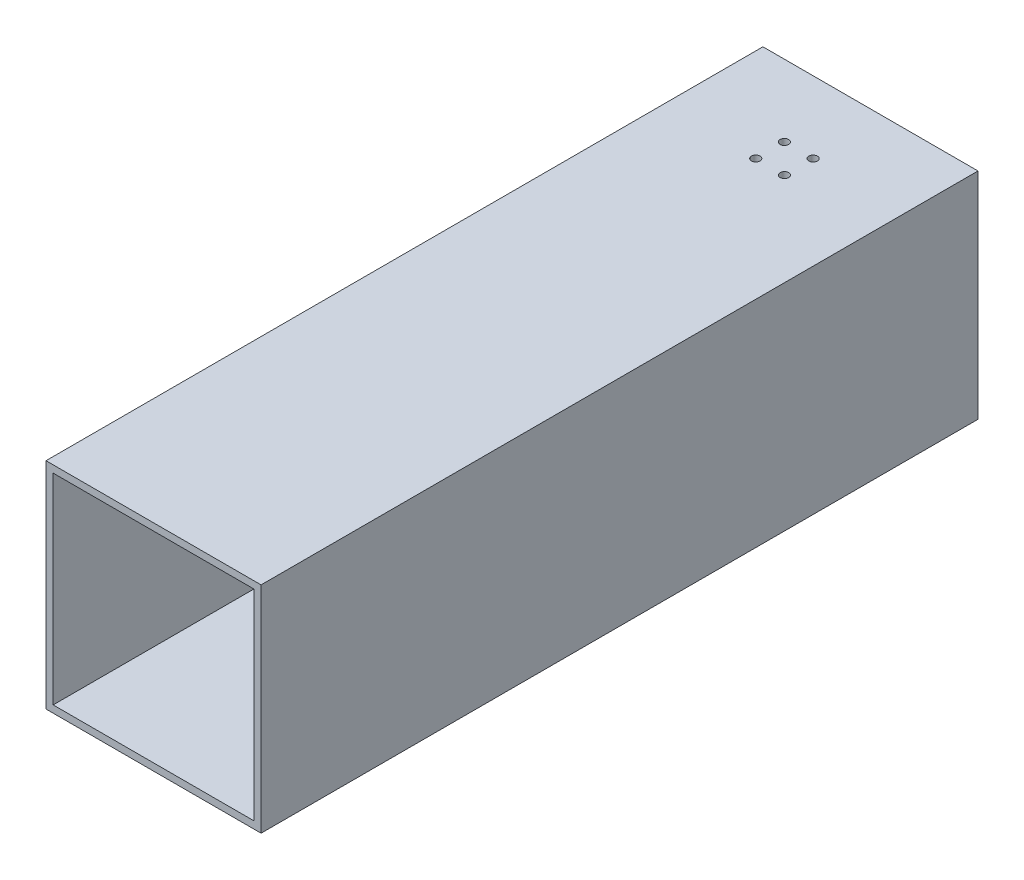
ISO-10303-21;
HEADER;
FILE_DESCRIPTION(('STEP AP214'),'2;1');
FILE_NAME('part.step','',(''),(''),'','','');
FILE_SCHEMA(('AUTOMOTIVE_DESIGN { 1 0 10303 214 1 1 1 1 }'));
ENDSEC;
DATA;
#1=APPLICATION_CONTEXT('core data for automotive mechanical design processes');
#2=APPLICATION_PROTOCOL_DEFINITION('international standard','automotive_design',2000,#1);
#3=PRODUCT_CONTEXT('',#1,'mechanical');
#4=PRODUCT('Part','Part','',(#3));
#5=PRODUCT_RELATED_PRODUCT_CATEGORY('part','',(#4));
#6=PRODUCT_DEFINITION_FORMATION('','',#4);
#7=PRODUCT_DEFINITION_CONTEXT('part definition',#1,'design');
#8=PRODUCT_DEFINITION('design','',#6,#7);
#9=PRODUCT_DEFINITION_SHAPE('','',#8);
#10=(LENGTH_UNIT() NAMED_UNIT(*) SI_UNIT(.MILLI.,.METRE.));
#11=(NAMED_UNIT(*) PLANE_ANGLE_UNIT() SI_UNIT($,.RADIAN.));
#12=(NAMED_UNIT(*) SI_UNIT($,.STERADIAN.) SOLID_ANGLE_UNIT());
#13=UNCERTAINTY_MEASURE_WITH_UNIT(LENGTH_MEASURE(1.E-05),#10,'distance_accuracy_value','');
#14=(GEOMETRIC_REPRESENTATION_CONTEXT(3) GLOBAL_UNCERTAINTY_ASSIGNED_CONTEXT((#13)) GLOBAL_UNIT_ASSIGNED_CONTEXT((#10,
#11,#12)) REPRESENTATION_CONTEXT('',''));
#15=CARTESIAN_POINT('',(0.,0.,0.));
#16=DIRECTION('',(0.,0.,1.));
#17=DIRECTION('',(1.,0.,0.));
#18=AXIS2_PLACEMENT_3D('',#15,#16,#17);
#19=CARTESIAN_POINT('',(75.,-75.0000000000001,500.));
#20=DIRECTION('',(-1.,0.,0.));
#21=DIRECTION('',(0.,0.,1.));
#22=AXIS2_PLACEMENT_3D('',#19,#20,#21);
#23=PLANE('',#22);
#24=DIRECTION('',(0.,1.,0.));
#25=VECTOR('',#24,1.);
#26=CARTESIAN_POINT('',(75.,-75.0000000000001,0.));
#27=LINE('',#26,#25);
#28=CARTESIAN_POINT('',(75.,-75.0000000000001,0.));
#29=VERTEX_POINT('',#28);
#30=CARTESIAN_POINT('',(75.,75.,0.));
#31=VERTEX_POINT('',#30);
#32=EDGE_CURVE('E137',#29,#31,#27,.T.);
#33=ORIENTED_EDGE('',*,*,#32,.T.);
#34=DIRECTION('',(0.,0.,-1.));
#35=VECTOR('',#34,1.);
#36=CARTESIAN_POINT('',(75.,75.,500.));
#37=LINE('',#36,#35);
#38=CARTESIAN_POINT('',(75.,75.,500.));
#39=VERTEX_POINT('',#38);
#40=EDGE_CURVE('E11',#39,#31,#37,.T.);
#41=ORIENTED_EDGE('',*,*,#40,.F.);
#42=DIRECTION('',(0.,1.,0.));
#43=VECTOR('',#42,1.);
#44=CARTESIAN_POINT('',(75.,-75.0000000000001,500.));
#45=LINE('',#44,#43);
#46=CARTESIAN_POINT('',(75.,-75.0000000000001,500.));
#47=VERTEX_POINT('',#46);
#48=EDGE_CURVE('E141',#47,#39,#45,.T.);
#49=ORIENTED_EDGE('',*,*,#48,.F.);
#50=DIRECTION('',(0.,0.,-1.));
#51=VECTOR('',#50,1.);
#52=CARTESIAN_POINT('',(75.,-75.0000000000001,500.));
#53=LINE('',#52,#51);
#54=EDGE_CURVE('E151',#47,#29,#53,.T.);
#55=ORIENTED_EDGE('',*,*,#54,.T.);
#56=EDGE_LOOP('',(#33,#41,#49,#55));
#57=FACE_BOUND('',#56,.T.);
#58=ADVANCED_FACE('F35',(#57),#23,.F.);
#59=CARTESIAN_POINT('',(-75.,75.,500.));
#60=DIRECTION('',(0.,-1.,0.));
#61=DIRECTION('',(0.,0.,-1.));
#62=AXIS2_PLACEMENT_3D('',#59,#60,#61);
#63=PLANE('',#62);
#64=CARTESIAN_POINT('',(-9.99999999999999,75.,50.));
#65=DIRECTION('',(0.,1.,0.));
#66=DIRECTION('',(0.,0.,1.));
#67=AXIS2_PLACEMENT_3D('',#64,#65,#66);
#68=CIRCLE('',#67,3.);
#69=CARTESIAN_POINT('',(-9.99999999999999,75.,53.));
#70=VERTEX_POINT('',#69);
#71=EDGE_CURVE('E370',#70,#70,#68,.T.);
#72=ORIENTED_EDGE('',*,*,#71,.F.);
#73=EDGE_LOOP('',(#72));
#74=FACE_BOUND('',#73,.T.);
#75=CARTESIAN_POINT('',(10.,75.,50.));
#76=DIRECTION('',(0.,1.,0.));
#77=DIRECTION('',(0.,0.,1.));
#78=AXIS2_PLACEMENT_3D('',#75,#76,#77);
#79=CIRCLE('',#78,3.);
#80=CARTESIAN_POINT('',(10.,75.,53.));
#81=VERTEX_POINT('',#80);
#82=EDGE_CURVE('E179',#81,#81,#79,.T.);
#83=ORIENTED_EDGE('',*,*,#82,.F.);
#84=EDGE_LOOP('',(#83));
#85=FACE_BOUND('',#84,.T.);
#86=CARTESIAN_POINT('',(10.,75.,70.));
#87=DIRECTION('',(0.,1.,0.));
#88=DIRECTION('',(0.,0.,1.));
#89=AXIS2_PLACEMENT_3D('',#86,#87,#88);
#90=CIRCLE('',#89,3.);
#91=CARTESIAN_POINT('',(10.,75.,73.));
#92=VERTEX_POINT('',#91);
#93=EDGE_CURVE('E176',#92,#92,#90,.T.);
#94=ORIENTED_EDGE('',*,*,#93,.F.);
#95=EDGE_LOOP('',(#94));
#96=FACE_BOUND('',#95,.T.);
#97=CARTESIAN_POINT('',(-9.99999999999999,75.,70.));
#98=DIRECTION('',(0.,1.,0.));
#99=DIRECTION('',(0.,0.,1.));
#100=AXIS2_PLACEMENT_3D('',#97,#98,#99);
#101=CIRCLE('',#100,3.);
#102=CARTESIAN_POINT('',(-9.99999999999999,75.,73.));
#103=VERTEX_POINT('',#102);
#104=EDGE_CURVE('E199',#103,#103,#101,.T.);
#105=ORIENTED_EDGE('',*,*,#104,.F.);
#106=EDGE_LOOP('',(#105));
#107=FACE_BOUND('',#106,.T.);
#108=DIRECTION('',(-1.,0.,0.));
#109=VECTOR('',#108,1.);
#110=CARTESIAN_POINT('',(-75.,75.,0.));
#111=LINE('',#110,#109);
#112=CARTESIAN_POINT('',(-75.,75.,0.));
#113=VERTEX_POINT('',#112);
#114=EDGE_CURVE('E154',#31,#113,#111,.T.);
#115=ORIENTED_EDGE('',*,*,#114,.T.);
#116=DIRECTION('',(0.,0.,-1.));
#117=VECTOR('',#116,1.);
#118=CARTESIAN_POINT('',(-75.,75.,500.));
#119=LINE('',#118,#117);
#120=CARTESIAN_POINT('',(-75.,75.,500.));
#121=VERTEX_POINT('',#120);
#122=EDGE_CURVE('E43',#121,#113,#119,.T.);
#123=ORIENTED_EDGE('',*,*,#122,.F.);
#124=DIRECTION('',(-1.,0.,0.));
#125=VECTOR('',#124,1.);
#126=CARTESIAN_POINT('',(-75.,75.,500.));
#127=LINE('',#126,#125);
#128=EDGE_CURVE('E144',#39,#121,#127,.T.);
#129=ORIENTED_EDGE('',*,*,#128,.F.);
#130=ORIENTED_EDGE('',*,*,#40,.T.);
#131=EDGE_LOOP('',(#115,#123,#129,#130));
#132=FACE_BOUND('',#131,.T.);
#133=ADVANCED_FACE('F235',(#74,#85,#96,#107,#132),#63,.F.);
#134=CARTESIAN_POINT('',(-75.,-75.0000000000001,500.));
#135=DIRECTION('',(1.,0.,0.));
#136=DIRECTION('',(0.,0.,-1.));
#137=AXIS2_PLACEMENT_3D('',#134,#135,#136);
#138=PLANE('',#137);
#139=DIRECTION('',(0.,-1.,0.));
#140=VECTOR('',#139,1.);
#141=CARTESIAN_POINT('',(-75.,-75.0000000000001,0.));
#142=LINE('',#141,#140);
#143=CARTESIAN_POINT('',(-75.,-75.0000000000001,0.));
#144=VERTEX_POINT('',#143);
#145=EDGE_CURVE('E156',#113,#144,#142,.T.);
#146=ORIENTED_EDGE('',*,*,#145,.T.);
#147=DIRECTION('',(0.,0.,-1.));
#148=VECTOR('',#147,1.);
#149=CARTESIAN_POINT('',(-75.,-75.0000000000001,500.));
#150=LINE('',#149,#148);
#151=CARTESIAN_POINT('',(-75.,-75.0000000000001,500.));
#152=VERTEX_POINT('',#151);
#153=EDGE_CURVE('E161',#152,#144,#150,.T.);
#154=ORIENTED_EDGE('',*,*,#153,.F.);
#155=DIRECTION('',(0.,-1.,0.));
#156=VECTOR('',#155,1.);
#157=CARTESIAN_POINT('',(-75.,-75.0000000000001,500.));
#158=LINE('',#157,#156);
#159=EDGE_CURVE('E147',#121,#152,#158,.T.);
#160=ORIENTED_EDGE('',*,*,#159,.F.);
#161=ORIENTED_EDGE('',*,*,#122,.T.);
#162=EDGE_LOOP('',(#146,#154,#160,#161));
#163=FACE_BOUND('',#162,.T.);
#164=ADVANCED_FACE('F241',(#163),#138,.F.);
#165=CARTESIAN_POINT('',(-75.,-75.0000000000001,500.));
#166=DIRECTION('',(0.,1.,0.));
#167=DIRECTION('',(0.,0.,1.));
#168=AXIS2_PLACEMENT_3D('',#165,#166,#167);
#169=PLANE('',#168);
#170=CARTESIAN_POINT('',(-9.99999999999999,-75.0000000000001,50.));
#171=DIRECTION('',(0.,1.,0.));
#172=DIRECTION('',(0.,0.,1.));
#173=AXIS2_PLACEMENT_3D('',#170,#171,#172);
#174=CIRCLE('',#173,2.99999999999998);
#175=CARTESIAN_POINT('',(-9.99999999999999,-75.0000000000001,53.));
#176=VERTEX_POINT('',#175);
#177=EDGE_CURVE('E364',#176,#176,#174,.T.);
#178=ORIENTED_EDGE('',*,*,#177,.T.);
#179=EDGE_LOOP('',(#178));
#180=FACE_BOUND('',#179,.T.);
#181=CARTESIAN_POINT('',(10.,-75.0000000000001,50.));
#182=DIRECTION('',(0.,1.,0.));
#183=DIRECTION('',(0.,0.,1.));
#184=AXIS2_PLACEMENT_3D('',#181,#182,#183);
#185=CIRCLE('',#184,2.99999999999998);
#186=CARTESIAN_POINT('',(10.,-75.0000000000001,53.));
#187=VERTEX_POINT('',#186);
#188=EDGE_CURVE('E172',#187,#187,#185,.T.);
#189=ORIENTED_EDGE('',*,*,#188,.T.);
#190=EDGE_LOOP('',(#189));
#191=FACE_BOUND('',#190,.T.);
#192=CARTESIAN_POINT('',(10.,-75.0000000000001,70.));
#193=DIRECTION('',(0.,1.,0.));
#194=DIRECTION('',(0.,0.,1.));
#195=AXIS2_PLACEMENT_3D('',#192,#193,#194);
#196=CIRCLE('',#195,2.99999999999998);
#197=CARTESIAN_POINT('',(10.,-75.0000000000001,73.));
#198=VERTEX_POINT('',#197);
#199=EDGE_CURVE('E190',#198,#198,#196,.T.);
#200=ORIENTED_EDGE('',*,*,#199,.T.);
#201=EDGE_LOOP('',(#200));
#202=FACE_BOUND('',#201,.T.);
#203=CARTESIAN_POINT('',(-9.99999999999999,-75.0000000000001,70.));
#204=DIRECTION('',(0.,1.,0.));
#205=DIRECTION('',(0.,0.,1.));
#206=AXIS2_PLACEMENT_3D('',#203,#204,#205);
#207=CIRCLE('',#206,2.99999999999998);
#208=CARTESIAN_POINT('',(-9.99999999999999,-75.0000000000001,73.));
#209=VERTEX_POINT('',#208);
#210=EDGE_CURVE('E168',#209,#209,#207,.T.);
#211=ORIENTED_EDGE('',*,*,#210,.T.);
#212=EDGE_LOOP('',(#211));
#213=FACE_BOUND('',#212,.T.);
#214=DIRECTION('',(1.,0.,0.));
#215=VECTOR('',#214,1.);
#216=CARTESIAN_POINT('',(-75.,-75.0000000000001,0.));
#217=LINE('',#216,#215);
#218=EDGE_CURVE('E145',#144,#29,#217,.T.);
#219=ORIENTED_EDGE('',*,*,#218,.T.);
#220=ORIENTED_EDGE('',*,*,#54,.F.);
#221=DIRECTION('',(1.,0.,0.));
#222=VECTOR('',#221,1.);
#223=CARTESIAN_POINT('',(-75.,-75.0000000000001,500.));
#224=LINE('',#223,#222);
#225=EDGE_CURVE('E149',#152,#47,#224,.T.);
#226=ORIENTED_EDGE('',*,*,#225,.F.);
#227=ORIENTED_EDGE('',*,*,#153,.T.);
#228=EDGE_LOOP('',(#219,#220,#226,#227));
#229=FACE_BOUND('',#228,.T.);
#230=ADVANCED_FACE('F204',(#180,#191,#202,#213,#229),#169,.F.);
#231=CARTESIAN_POINT('',(0.,0.,500.));
#232=DIRECTION('',(0.,0.,-1.));
#233=DIRECTION('',(-1.,0.,0.));
#234=AXIS2_PLACEMENT_3D('',#231,#232,#233);
#235=PLANE('',#234);
#236=DIRECTION('',(-1.,0.,0.));
#237=VECTOR('',#236,1.);
#238=CARTESIAN_POINT('',(-70.,70.,500.));
#239=LINE('',#238,#237);
#240=CARTESIAN_POINT('',(70.,70.,500.));
#241=VERTEX_POINT('',#240);
#242=CARTESIAN_POINT('',(-70.,70.,500.));
#243=VERTEX_POINT('',#242);
#244=EDGE_CURVE('E131',#241,#243,#239,.T.);
#245=ORIENTED_EDGE('',*,*,#244,.F.);
#246=DIRECTION('',(0.,1.,0.));
#247=VECTOR('',#246,1.);
#248=CARTESIAN_POINT('',(70.,-70.,500.));
#249=LINE('',#248,#247);
#250=CARTESIAN_POINT('',(70.,-70.,500.));
#251=VERTEX_POINT('',#250);
#252=EDGE_CURVE('E51',#251,#241,#249,.T.);
#253=ORIENTED_EDGE('',*,*,#252,.F.);
#254=DIRECTION('',(1.,0.,0.));
#255=VECTOR('',#254,1.);
#256=CARTESIAN_POINT('',(-70.,-70.,500.));
#257=LINE('',#256,#255);
#258=CARTESIAN_POINT('',(-70.,-70.,500.));
#259=VERTEX_POINT('',#258);
#260=EDGE_CURVE('E119',#259,#251,#257,.T.);
#261=ORIENTED_EDGE('',*,*,#260,.F.);
#262=DIRECTION('',(0.,-1.,0.));
#263=VECTOR('',#262,1.);
#264=CARTESIAN_POINT('',(-70.,-70.,500.));
#265=LINE('',#264,#263);
#266=EDGE_CURVE('E122',#243,#259,#265,.T.);
#267=ORIENTED_EDGE('',*,*,#266,.F.);
#268=EDGE_LOOP('',(#245,#253,#261,#267));
#269=FACE_BOUND('',#268,.T.);
#270=ORIENTED_EDGE('',*,*,#48,.T.);
#271=ORIENTED_EDGE('',*,*,#128,.T.);
#272=ORIENTED_EDGE('',*,*,#159,.T.);
#273=ORIENTED_EDGE('',*,*,#225,.T.);
#274=EDGE_LOOP('',(#270,#271,#272,#273));
#275=FACE_BOUND('',#274,.T.);
#276=ADVANCED_FACE('F225',(#269,#275),#235,.F.);
#277=CARTESIAN_POINT('',(0.,0.,0.));
#278=DIRECTION('',(0.,0.,-1.));
#279=DIRECTION('',(-1.,0.,0.));
#280=AXIS2_PLACEMENT_3D('',#277,#278,#279);
#281=PLANE('',#280);
#282=DIRECTION('',(0.,1.,0.));
#283=VECTOR('',#282,1.);
#284=CARTESIAN_POINT('',(70.,-70.,0.));
#285=LINE('',#284,#283);
#286=CARTESIAN_POINT('',(70.,-70.,0.));
#287=VERTEX_POINT('',#286);
#288=CARTESIAN_POINT('',(70.,70.,0.));
#289=VERTEX_POINT('',#288);
#290=EDGE_CURVE('E103',#287,#289,#285,.T.);
#291=ORIENTED_EDGE('',*,*,#290,.T.);
#292=DIRECTION('',(-1.,0.,0.));
#293=VECTOR('',#292,1.);
#294=CARTESIAN_POINT('',(-70.,70.,0.));
#295=LINE('',#294,#293);
#296=CARTESIAN_POINT('',(-70.,70.,0.));
#297=VERTEX_POINT('',#296);
#298=EDGE_CURVE('E112',#289,#297,#295,.T.);
#299=ORIENTED_EDGE('',*,*,#298,.T.);
#300=DIRECTION('',(0.,-1.,0.));
#301=VECTOR('',#300,1.);
#302=CARTESIAN_POINT('',(-70.,-70.,0.));
#303=LINE('',#302,#301);
#304=CARTESIAN_POINT('',(-70.,-70.,0.));
#305=VERTEX_POINT('',#304);
#306=EDGE_CURVE('E59',#297,#305,#303,.T.);
#307=ORIENTED_EDGE('',*,*,#306,.T.);
#308=DIRECTION('',(1.,0.,0.));
#309=VECTOR('',#308,1.);
#310=CARTESIAN_POINT('',(-70.,-70.,0.));
#311=LINE('',#310,#309);
#312=EDGE_CURVE('E109',#305,#287,#311,.T.);
#313=ORIENTED_EDGE('',*,*,#312,.T.);
#314=EDGE_LOOP('',(#291,#299,#307,#313));
#315=FACE_BOUND('',#314,.T.);
#316=ORIENTED_EDGE('',*,*,#32,.F.);
#317=ORIENTED_EDGE('',*,*,#218,.F.);
#318=ORIENTED_EDGE('',*,*,#145,.F.);
#319=ORIENTED_EDGE('',*,*,#114,.F.);
#320=EDGE_LOOP('',(#316,#317,#318,#319));
#321=FACE_BOUND('',#320,.T.);
#322=ADVANCED_FACE('F116',(#315,#321),#281,.T.);
#323=CARTESIAN_POINT('',(70.,-70.,0.));
#324=DIRECTION('',(1.,0.,0.));
#325=DIRECTION('',(0.,0.,-1.));
#326=AXIS2_PLACEMENT_3D('',#323,#324,#325);
#327=PLANE('',#326);
#328=ORIENTED_EDGE('',*,*,#252,.T.);
#329=DIRECTION('',(0.,0.,1.));
#330=VECTOR('',#329,1.);
#331=CARTESIAN_POINT('',(70.,70.,0.));
#332=LINE('',#331,#330);
#333=EDGE_CURVE('E99',#289,#241,#332,.T.);
#334=ORIENTED_EDGE('',*,*,#333,.F.);
#335=ORIENTED_EDGE('',*,*,#290,.F.);
#336=DIRECTION('',(0.,0.,1.));
#337=VECTOR('',#336,1.);
#338=CARTESIAN_POINT('',(70.,-70.,0.));
#339=LINE('',#338,#337);
#340=EDGE_CURVE('E135',#287,#251,#339,.T.);
#341=ORIENTED_EDGE('',*,*,#340,.T.);
#342=EDGE_LOOP('',(#328,#334,#335,#341));
#343=FACE_BOUND('',#342,.T.);
#344=ADVANCED_FACE('F101',(#343),#327,.F.);
#345=CARTESIAN_POINT('',(-70.,-70.,0.));
#346=DIRECTION('',(0.,-1.,0.));
#347=DIRECTION('',(0.,0.,-1.));
#348=AXIS2_PLACEMENT_3D('',#345,#346,#347);
#349=PLANE('',#348);
#350=CARTESIAN_POINT('',(-9.99999999999999,-70.,50.));
#351=DIRECTION('',(0.,-1.,0.));
#352=DIRECTION('',(0.,0.,-1.));
#353=AXIS2_PLACEMENT_3D('',#350,#351,#352);
#354=CIRCLE('',#353,2.99999999999999);
#355=CARTESIAN_POINT('',(-9.99999999999999,-70.,47.));
#356=VERTEX_POINT('',#355);
#357=EDGE_CURVE('E184',#356,#356,#354,.T.);
#358=ORIENTED_EDGE('',*,*,#357,.T.);
#359=EDGE_LOOP('',(#358));
#360=FACE_BOUND('',#359,.T.);
#361=CARTESIAN_POINT('',(10.,-70.,50.));
#362=DIRECTION('',(0.,-1.,0.));
#363=DIRECTION('',(0.,0.,-1.));
#364=AXIS2_PLACEMENT_3D('',#361,#362,#363);
#365=CIRCLE('',#364,2.99999999999999);
#366=CARTESIAN_POINT('',(10.,-70.,47.));
#367=VERTEX_POINT('',#366);
#368=EDGE_CURVE('E171',#367,#367,#365,.T.);
#369=ORIENTED_EDGE('',*,*,#368,.T.);
#370=EDGE_LOOP('',(#369));
#371=FACE_BOUND('',#370,.T.);
#372=CARTESIAN_POINT('',(10.,-70.,70.));
#373=DIRECTION('',(0.,-1.,0.));
#374=DIRECTION('',(0.,0.,-1.));
#375=AXIS2_PLACEMENT_3D('',#372,#373,#374);
#376=CIRCLE('',#375,2.99999999999999);
#377=CARTESIAN_POINT('',(10.,-70.,67.));
#378=VERTEX_POINT('',#377);
#379=EDGE_CURVE('E193',#378,#378,#376,.T.);
#380=ORIENTED_EDGE('',*,*,#379,.T.);
#381=EDGE_LOOP('',(#380));
#382=FACE_BOUND('',#381,.T.);
#383=CARTESIAN_POINT('',(-9.99999999999999,-70.,70.));
#384=DIRECTION('',(0.,-1.,0.));
#385=DIRECTION('',(0.,0.,-1.));
#386=AXIS2_PLACEMENT_3D('',#383,#384,#385);
#387=CIRCLE('',#386,2.99999999999999);
#388=CARTESIAN_POINT('',(-9.99999999999999,-70.,67.));
#389=VERTEX_POINT('',#388);
#390=EDGE_CURVE('E125',#389,#389,#387,.T.);
#391=ORIENTED_EDGE('',*,*,#390,.T.);
#392=EDGE_LOOP('',(#391));
#393=FACE_BOUND('',#392,.T.);
#394=ORIENTED_EDGE('',*,*,#260,.T.);
#395=ORIENTED_EDGE('',*,*,#340,.F.);
#396=ORIENTED_EDGE('',*,*,#312,.F.);
#397=DIRECTION('',(0.,0.,1.));
#398=VECTOR('',#397,1.);
#399=CARTESIAN_POINT('',(-70.,-70.,0.));
#400=LINE('',#399,#398);
#401=EDGE_CURVE('E138',#305,#259,#400,.T.);
#402=ORIENTED_EDGE('',*,*,#401,.T.);
#403=EDGE_LOOP('',(#394,#395,#396,#402));
#404=FACE_BOUND('',#403,.T.);
#405=ADVANCED_FACE('F216',(#360,#371,#382,#393,#404),#349,.F.);
#406=CARTESIAN_POINT('',(-70.,-70.,0.));
#407=DIRECTION('',(-1.,0.,0.));
#408=DIRECTION('',(0.,0.,1.));
#409=AXIS2_PLACEMENT_3D('',#406,#407,#408);
#410=PLANE('',#409);
#411=ORIENTED_EDGE('',*,*,#266,.T.);
#412=ORIENTED_EDGE('',*,*,#401,.F.);
#413=ORIENTED_EDGE('',*,*,#306,.F.);
#414=DIRECTION('',(0.,0.,1.));
#415=VECTOR('',#414,1.);
#416=CARTESIAN_POINT('',(-70.,70.,0.));
#417=LINE('',#416,#415);
#418=EDGE_CURVE('E108',#297,#243,#417,.T.);
#419=ORIENTED_EDGE('',*,*,#418,.T.);
#420=EDGE_LOOP('',(#411,#412,#413,#419));
#421=FACE_BOUND('',#420,.T.);
#422=ADVANCED_FACE('F219',(#421),#410,.F.);
#423=CARTESIAN_POINT('',(-70.,70.,0.));
#424=DIRECTION('',(0.,1.,0.));
#425=DIRECTION('',(0.,0.,1.));
#426=AXIS2_PLACEMENT_3D('',#423,#424,#425);
#427=PLANE('',#426);
#428=CARTESIAN_POINT('',(-9.99999999999999,70.,50.));
#429=DIRECTION('',(0.,1.,0.));
#430=DIRECTION('',(0.,0.,1.));
#431=AXIS2_PLACEMENT_3D('',#428,#429,#430);
#432=CIRCLE('',#431,2.99999999999999);
#433=CARTESIAN_POINT('',(-9.99999999999999,70.,53.));
#434=VERTEX_POINT('',#433);
#435=EDGE_CURVE('E38',#434,#434,#432,.T.);
#436=ORIENTED_EDGE('',*,*,#435,.T.);
#437=EDGE_LOOP('',(#436));
#438=FACE_BOUND('',#437,.T.);
#439=CARTESIAN_POINT('',(10.,70.,50.));
#440=DIRECTION('',(0.,1.,0.));
#441=DIRECTION('',(0.,0.,1.));
#442=AXIS2_PLACEMENT_3D('',#439,#440,#441);
#443=CIRCLE('',#442,2.99999999999999);
#444=CARTESIAN_POINT('',(10.,70.,53.));
#445=VERTEX_POINT('',#444);
#446=EDGE_CURVE('E169',#445,#445,#443,.T.);
#447=ORIENTED_EDGE('',*,*,#446,.T.);
#448=EDGE_LOOP('',(#447));
#449=FACE_BOUND('',#448,.T.);
#450=CARTESIAN_POINT('',(10.,70.,70.));
#451=DIRECTION('',(0.,1.,0.));
#452=DIRECTION('',(0.,0.,1.));
#453=AXIS2_PLACEMENT_3D('',#450,#451,#452);
#454=CIRCLE('',#453,2.99999999999999);
#455=CARTESIAN_POINT('',(10.,70.,73.));
#456=VERTEX_POINT('',#455);
#457=EDGE_CURVE('E196',#456,#456,#454,.T.);
#458=ORIENTED_EDGE('',*,*,#457,.T.);
#459=EDGE_LOOP('',(#458));
#460=FACE_BOUND('',#459,.T.);
#461=CARTESIAN_POINT('',(-9.99999999999999,70.,70.));
#462=DIRECTION('',(0.,1.,0.));
#463=DIRECTION('',(0.,0.,1.));
#464=AXIS2_PLACEMENT_3D('',#461,#462,#463);
#465=CIRCLE('',#464,2.99999999999999);
#466=CARTESIAN_POINT('',(-9.99999999999999,70.,73.));
#467=VERTEX_POINT('',#466);
#468=EDGE_CURVE('E166',#467,#467,#465,.T.);
#469=ORIENTED_EDGE('',*,*,#468,.T.);
#470=EDGE_LOOP('',(#469));
#471=FACE_BOUND('',#470,.T.);
#472=ORIENTED_EDGE('',*,*,#244,.T.);
#473=ORIENTED_EDGE('',*,*,#418,.F.);
#474=ORIENTED_EDGE('',*,*,#298,.F.);
#475=ORIENTED_EDGE('',*,*,#333,.T.);
#476=EDGE_LOOP('',(#472,#473,#474,#475));
#477=FACE_BOUND('',#476,.T.);
#478=ADVANCED_FACE('F113',(#438,#449,#460,#471,#477),#427,.F.);
#479=CARTESIAN_POINT('',(-9.99999999999999,75.,70.));
#480=DIRECTION('',(0.,1.,0.));
#481=DIRECTION('',(0.,0.,1.));
#482=AXIS2_PLACEMENT_3D('',#479,#480,#481);
#483=CYLINDRICAL_SURFACE('',#482,2.99999999999999);
#484=ORIENTED_EDGE('',*,*,#104,.T.);
#485=EDGE_LOOP('',(#484));
#486=FACE_BOUND('',#485,.T.);
#487=ORIENTED_EDGE('',*,*,#468,.F.);
#488=EDGE_LOOP('',(#487));
#489=FACE_BOUND('',#488,.T.);
#490=ADVANCED_FACE('F211',(#486,#489),#483,.F.);
#491=ORIENTED_EDGE('',*,*,#210,.F.);
#492=EDGE_LOOP('',(#491));
#493=FACE_BOUND('',#492,.T.);
#494=ORIENTED_EDGE('',*,*,#390,.F.);
#495=EDGE_LOOP('',(#494));
#496=FACE_BOUND('',#495,.T.);
#497=ADVANCED_FACE('F207',(#493,#496),#483,.F.);
#498=CARTESIAN_POINT('',(10.,75.,70.));
#499=DIRECTION('',(0.,1.,0.));
#500=DIRECTION('',(0.,0.,1.));
#501=AXIS2_PLACEMENT_3D('',#498,#499,#500);
#502=CYLINDRICAL_SURFACE('',#501,2.99999999999999);
#503=ORIENTED_EDGE('',*,*,#93,.T.);
#504=EDGE_LOOP('',(#503));
#505=FACE_BOUND('',#504,.T.);
#506=ORIENTED_EDGE('',*,*,#457,.F.);
#507=EDGE_LOOP('',(#506));
#508=FACE_BOUND('',#507,.T.);
#509=ADVANCED_FACE('F210',(#505,#508),#502,.F.);
#510=ORIENTED_EDGE('',*,*,#199,.F.);
#511=EDGE_LOOP('',(#510));
#512=FACE_BOUND('',#511,.T.);
#513=ORIENTED_EDGE('',*,*,#379,.F.);
#514=EDGE_LOOP('',(#513));
#515=FACE_BOUND('',#514,.T.);
#516=ADVANCED_FACE('F310',(#512,#515),#502,.F.);
#517=CARTESIAN_POINT('',(10.,75.,50.));
#518=DIRECTION('',(0.,1.,0.));
#519=DIRECTION('',(0.,0.,1.));
#520=AXIS2_PLACEMENT_3D('',#517,#518,#519);
#521=CYLINDRICAL_SURFACE('',#520,2.99999999999999);
#522=ORIENTED_EDGE('',*,*,#82,.T.);
#523=EDGE_LOOP('',(#522));
#524=FACE_BOUND('',#523,.T.);
#525=ORIENTED_EDGE('',*,*,#446,.F.);
#526=EDGE_LOOP('',(#525));
#527=FACE_BOUND('',#526,.T.);
#528=ADVANCED_FACE('F320',(#524,#527),#521,.F.);
#529=ORIENTED_EDGE('',*,*,#188,.F.);
#530=EDGE_LOOP('',(#529));
#531=FACE_BOUND('',#530,.T.);
#532=ORIENTED_EDGE('',*,*,#368,.F.);
#533=EDGE_LOOP('',(#532));
#534=FACE_BOUND('',#533,.T.);
#535=ADVANCED_FACE('F329',(#531,#534),#521,.F.);
#536=CARTESIAN_POINT('',(-9.99999999999999,75.,50.));
#537=DIRECTION('',(0.,1.,0.));
#538=DIRECTION('',(0.,0.,1.));
#539=AXIS2_PLACEMENT_3D('',#536,#537,#538);
#540=CYLINDRICAL_SURFACE('',#539,2.99999999999999);
#541=ORIENTED_EDGE('',*,*,#71,.T.);
#542=EDGE_LOOP('',(#541));
#543=FACE_BOUND('',#542,.T.);
#544=ORIENTED_EDGE('',*,*,#435,.F.);
#545=EDGE_LOOP('',(#544));
#546=FACE_BOUND('',#545,.T.);
#547=ADVANCED_FACE('F339',(#543,#546),#540,.F.);
#548=ORIENTED_EDGE('',*,*,#177,.F.);
#549=EDGE_LOOP('',(#548));
#550=FACE_BOUND('',#549,.T.);
#551=ORIENTED_EDGE('',*,*,#357,.F.);
#552=EDGE_LOOP('',(#551));
#553=FACE_BOUND('',#552,.T.);
#554=ADVANCED_FACE('F348',(#550,#553),#540,.F.);
#555=CLOSED_SHELL('',(#58,#133,#164,#230,#276,#322,#344,#405,#422,#478,#490,#497,#509,#516,#528,
#535,#547,#554));
#556=MANIFOLD_SOLID_BREP('B2',#555);
#557=ADVANCED_BREP_SHAPE_REPRESENTATION('',(#18,#556),#14);
#558=SHAPE_DEFINITION_REPRESENTATION(#9,#557);
ENDSEC;
END-ISO-10303-21;
